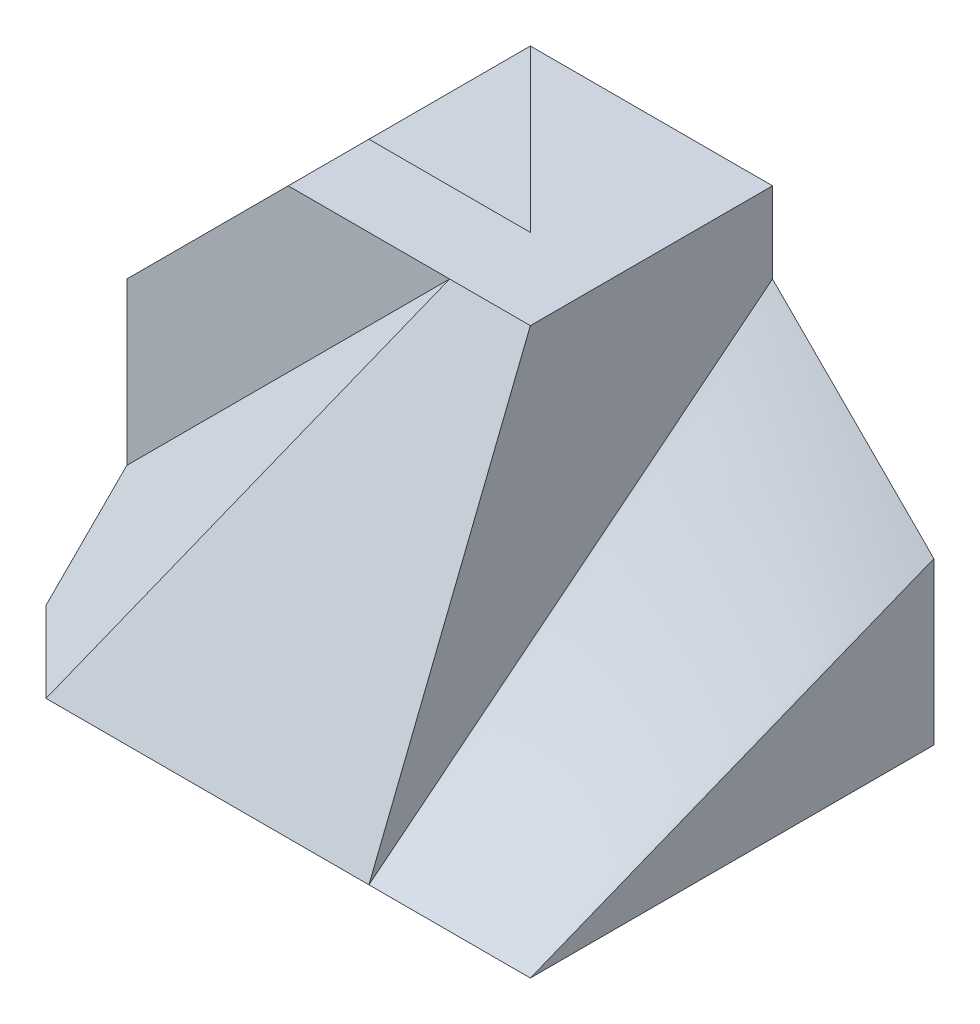
ISO-10303-21;
HEADER;
FILE_DESCRIPTION(('STEP AP214'),'2;1');
FILE_NAME('part.step','',(''),(''),'','','');
FILE_SCHEMA(('AUTOMOTIVE_DESIGN { 1 0 10303 214 1 1 1 1 }'));
ENDSEC;
DATA;
#1=APPLICATION_CONTEXT('core data for automotive mechanical design processes');
#2=APPLICATION_PROTOCOL_DEFINITION('international standard','automotive_design',2000,#1);
#3=PRODUCT_CONTEXT('',#1,'mechanical');
#4=PRODUCT('Part','Part','',(#3));
#5=PRODUCT_RELATED_PRODUCT_CATEGORY('part','',(#4));
#6=PRODUCT_DEFINITION_FORMATION('','',#4);
#7=PRODUCT_DEFINITION_CONTEXT('part definition',#1,'design');
#8=PRODUCT_DEFINITION('design','',#6,#7);
#9=PRODUCT_DEFINITION_SHAPE('','',#8);
#10=(LENGTH_UNIT() NAMED_UNIT(*) SI_UNIT(.MILLI.,.METRE.));
#11=(NAMED_UNIT(*) PLANE_ANGLE_UNIT() SI_UNIT($,.RADIAN.));
#12=(NAMED_UNIT(*) SI_UNIT($,.STERADIAN.) SOLID_ANGLE_UNIT());
#13=UNCERTAINTY_MEASURE_WITH_UNIT(LENGTH_MEASURE(1.E-05),#10,'distance_accuracy_value','');
#14=(GEOMETRIC_REPRESENTATION_CONTEXT(3) GLOBAL_UNCERTAINTY_ASSIGNED_CONTEXT((#13)) GLOBAL_UNIT_ASSIGNED_CONTEXT((#10,
#11,#12)) REPRESENTATION_CONTEXT('',''));
#15=CARTESIAN_POINT('',(0.,0.,0.));
#16=DIRECTION('',(0.,0.,1.));
#17=DIRECTION('',(1.,0.,0.));
#18=AXIS2_PLACEMENT_3D('',#15,#16,#17);
#19=CARTESIAN_POINT('',(0.,2.5,5.));
#20=DIRECTION('',(0.,1.,0.));
#21=DIRECTION('',(0.,0.,1.));
#22=AXIS2_PLACEMENT_3D('',#19,#20,#21);
#23=PLANE('',#22);
#24=DIRECTION('',(1.,0.,0.));
#25=VECTOR('',#24,1.);
#26=CARTESIAN_POINT('',(0.,2.5,0.));
#27=LINE('',#26,#25);
#28=CARTESIAN_POINT('',(-1.5,2.5,0.));
#29=VERTEX_POINT('',#28);
#30=CARTESIAN_POINT('',(1.5,2.5,0.));
#31=VERTEX_POINT('',#30);
#32=EDGE_CURVE('E273',#29,#31,#27,.T.);
#33=ORIENTED_EDGE('',*,*,#32,.F.);
#34=DIRECTION('',(-0.707106781186548,0.,-0.707106781186548));
#35=VECTOR('',#34,1.);
#36=CARTESIAN_POINT('',(0.5,2.5,2.));
#37=LINE('',#36,#35);
#38=CARTESIAN_POINT('',(0.5,2.5,2.));
#39=VERTEX_POINT('',#38);
#40=EDGE_CURVE('E395',#39,#29,#37,.T.);
#41=ORIENTED_EDGE('',*,*,#40,.F.);
#42=DIRECTION('',(-1.,0.,0.));
#43=VECTOR('',#42,1.);
#44=CARTESIAN_POINT('',(0.5,2.5,2.));
#45=LINE('',#44,#43);
#46=CARTESIAN_POINT('',(-1.5,2.5,2.));
#47=VERTEX_POINT('',#46);
#48=EDGE_CURVE('E397',#39,#47,#45,.T.);
#49=ORIENTED_EDGE('',*,*,#48,.T.);
#50=DIRECTION('',(0.,0.,-1.));
#51=VECTOR('',#50,1.);
#52=CARTESIAN_POINT('',(-1.5,2.5,5.));
#53=LINE('',#52,#51);
#54=CARTESIAN_POINT('',(-1.5,2.5,3.00000876569495));
#55=VERTEX_POINT('',#54);
#56=EDGE_CURVE('E203',#55,#47,#53,.T.);
#57=ORIENTED_EDGE('',*,*,#56,.F.);
#58=DIRECTION('',(0.999999999990395,0.,4.38284747471509E-06));
#59=VECTOR('',#58,1.);
#60=CARTESIAN_POINT('',(8.76562771661403E-06,2.5,3.00001534000458));
#61=LINE('',#60,#59);
#62=CARTESIAN_POINT('',(0.499979561030127,2.50000584373526,3.00001753130032));
#63=VERTEX_POINT('',#62);
#64=EDGE_CURVE('E57',#55,#63,#61,.T.);
#65=ORIENTED_EDGE('',*,*,#64,.T.);
#66=CARTESIAN_POINT('',(0.500000018550914,2.5,3.00000000000068));
#67=DIRECTION('',(0.999999985410378,0.,0.000170819331714001));
#68=VECTOR('',#67,1.);
#69=LINE('',#66,#68);
#70=CARTESIAN_POINT('',(1.5,2.5,3.0001369257335));
#71=VERTEX_POINT('',#70);
#72=EDGE_CURVE('E312',#63,#71,#69,.T.);
#73=ORIENTED_EDGE('',*,*,#72,.T.);
#74=DIRECTION('',(0.,0.,-1.));
#75=VECTOR('',#74,1.);
#76=CARTESIAN_POINT('',(1.5,2.5,5.));
#77=LINE('',#76,#75);
#78=EDGE_CURVE('E310',#71,#31,#77,.T.);
#79=ORIENTED_EDGE('',*,*,#78,.T.);
#80=EDGE_LOOP('',(#33,#41,#49,#57,#65,#73,#79));
#81=FACE_BOUND('',#80,.T.);
#82=ADVANCED_FACE('F38',(#81),#23,.T.);
#83=CARTESIAN_POINT('',(-2.,2.,5.));
#84=DIRECTION('',(-0.707106781186548,0.707106781186548,0.));
#85=DIRECTION('',(-0.707106781186548,-0.707106781186548,0.));
#86=AXIS2_PLACEMENT_3D('',#83,#84,#85);
#87=PLANE('',#86);
#88=DIRECTION('',(0.707106781186548,0.707106781186548,0.));
#89=VECTOR('',#88,1.);
#90=CARTESIAN_POINT('',(-2.,2.,2.));
#91=LINE('',#90,#89);
#92=CARTESIAN_POINT('',(-3.5,0.5,2.));
#93=VERTEX_POINT('',#92);
#94=EDGE_CURVE('E384',#93,#47,#91,.T.);
#95=ORIENTED_EDGE('',*,*,#94,.F.);
#96=DIRECTION('',(0.,0.,-1.));
#97=VECTOR('',#96,1.);
#98=CARTESIAN_POINT('',(-3.5,0.5,5.));
#99=LINE('',#98,#97);
#100=CARTESIAN_POINT('',(-3.5,0.5,3.));
#101=VERTEX_POINT('',#100);
#102=EDGE_CURVE('E425',#101,#93,#99,.T.);
#103=ORIENTED_EDGE('',*,*,#102,.F.);
#104=DIRECTION('',(0.707106781183152,0.707106781183152,3.09914117029226E-06));
#105=VECTOR('',#104,1.);
#106=CARTESIAN_POINT('',(-1.99999561716693,2.00000438283307,3.00000657429042));
#107=LINE('',#106,#105);
#108=EDGE_CURVE('E207',#101,#55,#107,.T.);
#109=ORIENTED_EDGE('',*,*,#108,.T.);
#110=ORIENTED_EDGE('',*,*,#56,.T.);
#111=EDGE_LOOP('',(#95,#103,#109,#110));
#112=FACE_BOUND('',#111,.T.);
#113=ADVANCED_FACE('F40',(#112),#87,.T.);
#114=CARTESIAN_POINT('',(-3.5,0.,5.));
#115=DIRECTION('',(-1.,0.,0.));
#116=DIRECTION('',(0.,0.,1.));
#117=AXIS2_PLACEMENT_3D('',#114,#115,#116);
#118=PLANE('',#117);
#119=DIRECTION('',(0.,-0.707106781186548,0.707106781186548));
#120=VECTOR('',#119,1.);
#121=CARTESIAN_POINT('',(-3.5,0.5,0.));
#122=LINE('',#121,#120);
#123=CARTESIAN_POINT('',(-3.5,0.5,0.));
#124=VERTEX_POINT('',#123);
#125=CARTESIAN_POINT('',(-3.5,-1.5,2.));
#126=VERTEX_POINT('',#125);
#127=EDGE_CURVE('E402',#124,#126,#122,.T.);
#128=ORIENTED_EDGE('',*,*,#127,.F.);
#129=DIRECTION('',(0.,1.,0.));
#130=VECTOR('',#129,1.);
#131=CARTESIAN_POINT('',(-3.5,0.,0.));
#132=LINE('',#131,#130);
#133=CARTESIAN_POINT('',(-3.5,-2.5,0.));
#134=VERTEX_POINT('',#133);
#135=EDGE_CURVE('E282',#134,#124,#132,.T.);
#136=ORIENTED_EDGE('',*,*,#135,.F.);
#137=DIRECTION('',(0.,0.,-1.));
#138=VECTOR('',#137,1.);
#139=CARTESIAN_POINT('',(-3.5,-2.5,5.));
#140=LINE('',#139,#138);
#141=CARTESIAN_POINT('',(-3.5,-2.5,3.99996610640178));
#142=VERTEX_POINT('',#141);
#143=EDGE_CURVE('E209',#142,#134,#140,.T.);
#144=ORIENTED_EDGE('',*,*,#143,.F.);
#145=DIRECTION('',(0.,0.707118764484653,-0.707094797685359));
#146=VECTOR('',#145,1.);
#147=CARTESIAN_POINT('',(-3.5,-2.5,3.99996610640178));
#148=LINE('',#147,#146);
#149=CARTESIAN_POINT('',(-3.5,-1.5,3.));
#150=VERTEX_POINT('',#149);
#151=EDGE_CURVE('E206',#142,#150,#148,.T.);
#152=ORIENTED_EDGE('',*,*,#151,.T.);
#153=DIRECTION('',(0.,1.,0.));
#154=VECTOR('',#153,1.);
#155=CARTESIAN_POINT('',(-3.5,-1.5,3.));
#156=LINE('',#155,#154);
#157=EDGE_CURVE('E529',#150,#101,#156,.T.);
#158=ORIENTED_EDGE('',*,*,#157,.T.);
#159=ORIENTED_EDGE('',*,*,#102,.T.);
#160=DIRECTION('',(0.,1.,0.));
#161=VECTOR('',#160,1.);
#162=CARTESIAN_POINT('',(-3.5,0.,2.));
#163=LINE('',#162,#161);
#164=EDGE_CURVE('E12',#126,#93,#163,.T.);
#165=ORIENTED_EDGE('',*,*,#164,.F.);
#166=EDGE_LOOP('',(#128,#136,#144,#152,#158,#159,#165));
#167=FACE_BOUND('',#166,.T.);
#168=ADVANCED_FACE('F336',(#167),#118,.T.);
#169=CARTESIAN_POINT('',(-0.000121535789236566,1.37933127299265,3.44831886277038));
#170=DIRECTION('',(-3.27240924574146E-05,0.37139154145744,0.928476344266778));
#171=DIRECTION('',(0.,-0.928476344763915,0.371391541656295));
#172=AXIS2_PLACEMENT_3D('',#169,#170,#171);
#173=PLANE('',#172);
#174=ORIENTED_EDGE('',*,*,#72,.F.);
#175=CARTESIAN_POINT('',(0.500097247583984,2.50029743964666,2.99994881444319));
#176=DIRECTION('',(-0.486656341146237,-0.811116815373522,0.32443045085268));
#177=VECTOR('',#176,1.);
#178=LINE('',#175,#177);
#179=CARTESIAN_POINT('',(-2.50000107027692,-2.50000294733509,4.99998490778983));
#180=VERTEX_POINT('',#179);
#181=EDGE_CURVE('E74',#63,#180,#178,.T.);
#182=ORIENTED_EDGE('',*,*,#181,.T.);
#183=CARTESIAN_POINT('',(-2.50000107027692,-2.50000589467018,4.99996981557966));
#184=DIRECTION('',(0.999999999448109,1.74802895943676E-05,2.82528046121385E-05));
#185=VECTOR('',#184,1.);
#186=LINE('',#183,#185);
#187=CARTESIAN_POINT('',(-1.57668284722899,-2.49999352934338,5.00000132108726));
#188=VERTEX_POINT('',#187);
#189=EDGE_CURVE('E121',#180,#188,#186,.T.);
#190=ORIENTED_EDGE('',*,*,#189,.T.);
#191=CARTESIAN_POINT('',(1.50007116417084,-2.5,5.));
#192=DIRECTION('',(-1.,0.,0.));
#193=VECTOR('',#192,1.);
#194=LINE('',#191,#193);
#195=CARTESIAN_POINT('',(1.5000711610525,-2.49965825417712,4.99997523280236));
#196=VERTEX_POINT('',#195);
#197=EDGE_CURVE('E127',#196,#188,#194,.T.);
#198=ORIENTED_EDGE('',*,*,#197,.F.);
#199=DIRECTION('',(0.,0.928476344763915,-0.371391541656295));
#200=VECTOR('',#199,1.);
#201=CARTESIAN_POINT('',(1.5,-2.50128790355298,5.00062360031391));
#202=LINE('',#201,#200);
#203=EDGE_CURVE('E133',#71,#196,#202,.F.);
#204=ORIENTED_EDGE('',*,*,#203,.F.);
#205=EDGE_LOOP('',(#174,#182,#190,#198,#204));
#206=FACE_BOUND('',#205,.T.);
#207=ADVANCED_FACE('F125',(#206),#173,.T.);
#208=CARTESIAN_POINT('',(1.5,0.,5.));
#209=DIRECTION('',(-1.,0.,0.));
#210=DIRECTION('',(0.,0.,1.));
#211=AXIS2_PLACEMENT_3D('',#208,#209,#210);
#212=PLANE('',#211);
#213=ORIENTED_EDGE('',*,*,#203,.T.);
#214=CARTESIAN_POINT('',(1.49999541451765,1.49999082903529,-5.50257882268755E-06));
#215=CARTESIAN_POINT('',(1.49994840950657,1.3332323725204,0.20826864952381));
#216=CARTESIAN_POINT('',(1.49991057515742,1.16649045298448,0.416556061851853));
#217=CARTESIAN_POINT('',(1.49986614044278,0.833069081610766,0.833168367624807));
#218=CARTESIAN_POINT('',(1.49985953893356,0.666389627709042,1.04149325941788));
#219=CARTESIAN_POINT('',(1.49989045658665,0.333117275337244,1.45819809519905));
#220=CARTESIAN_POINT('',(1.49992797391927,0.166524373564357,1.66657803654587));
#221=CARTESIAN_POINT('',(1.50000805383974,-0.166651293610344,2.08334391621995));
#222=CARTESIAN_POINT('',(1.50005061639657,-0.333234059068155,2.2917298545025));
#223=CARTESIAN_POINT('',(1.50010301782544,-0.666464239919107,2.70846146585302));
#224=CARTESIAN_POINT('',(1.50011285560424,-0.833111657286091,2.9168071373433));
#225=CARTESIAN_POINT('',(1.50008689268971,-1.1664963645163,3.33344195859731));
#226=CARTESIAN_POINT('',(1.50005108993744,-1.33323365809484,3.54173110538708));
#227=CARTESIAN_POINT('',(1.4999637716378,-1.66673666416649,3.95828678526797));
#228=CARTESIAN_POINT('',(1.4999122560861,-1.83350237666742,4.16655331835284));
#229=CARTESIAN_POINT('',(1.49991631024563,-2.16681963524899,4.58321489197007));
#230=CARTESIAN_POINT('',(1.4999718665587,-2.33337120551616,4.79160991316237));
#231=CARTESIAN_POINT('',(1.50014232834133,-2.49971534300216,5.00017079361561));
#232=B_SPLINE_CURVE_WITH_KNOTS('',3,(#214,#215,#216,#217,#218,#219,#220,#221,#222,#223,#224,
#225,#226,#227,#228,#229,#230,#231),.UNSPECIFIED.,.F.,.F.,(4,2,2,2,2,2,2,2,4),(0.,
0.800424014052249,1.60081871712363,2.40118022772789,3.20153682000441,4.00192014969071,
4.80233958770883,5.60275924609179,6.40307875246659),.UNSPECIFIED.);
#233=CARTESIAN_POINT('',(1.49999770725882,1.49999541451765,-2.75128941137549E-06));
#234=VERTEX_POINT('',#233);
#235=EDGE_CURVE('E269',#234,#196,#232,.T.);
#236=ORIENTED_EDGE('',*,*,#235,.F.);
#237=DIRECTION('',(0.,1.,0.));
#238=VECTOR('',#237,1.);
#239=CARTESIAN_POINT('',(1.5,0.,0.));
#240=LINE('',#239,#238);
#241=EDGE_CURVE('E304',#234,#31,#240,.T.);
#242=ORIENTED_EDGE('',*,*,#241,.T.);
#243=ORIENTED_EDGE('',*,*,#78,.F.);
#244=EDGE_LOOP('',(#213,#236,#242,#243));
#245=FACE_BOUND('',#244,.T.);
#246=ADVANCED_FACE('F166',(#245),#212,.F.);
#247=CARTESIAN_POINT('',(0.,-2.5,5.));
#248=DIRECTION('',(0.,1.,0.));
#249=DIRECTION('',(0.,0.,1.));
#250=AXIS2_PLACEMENT_3D('',#247,#248,#249);
#251=PLANE('',#250);
#252=ORIENTED_EDGE('',*,*,#189,.F.);
#253=DIRECTION('',(-0.707105469769942,4.16814030065119E-06,-0.707108092588436));
#254=VECTOR('',#253,1.);
#255=CARTESIAN_POINT('',(-2.50000000002425,-2.50000589465148,4.9999698156099));
#256=LINE('',#255,#254);
#257=EDGE_CURVE('E78',#180,#142,#256,.T.);
#258=ORIENTED_EDGE('',*,*,#257,.T.);
#259=ORIENTED_EDGE('',*,*,#143,.T.);
#260=DIRECTION('',(1.,0.,0.));
#261=VECTOR('',#260,1.);
#262=CARTESIAN_POINT('',(0.,-2.5,0.));
#263=LINE('',#262,#261);
#264=CARTESIAN_POINT('',(3.5,-2.5,0.));
#265=VERTEX_POINT('',#264);
#266=EDGE_CURVE('E143',#134,#265,#263,.T.);
#267=ORIENTED_EDGE('',*,*,#266,.T.);
#268=DIRECTION('',(0.,0.,-1.));
#269=VECTOR('',#268,1.);
#270=CARTESIAN_POINT('',(3.5,-2.5,5.));
#271=LINE('',#270,#269);
#272=CARTESIAN_POINT('',(3.49991274206597,-2.50017451586807,4.99881665488389));
#273=VERTEX_POINT('',#272);
#274=EDGE_CURVE('E197',#273,#265,#271,.T.);
#275=ORIENTED_EDGE('',*,*,#274,.F.);
#276=CARTESIAN_POINT('',(3.36726331566733,-2.4999999999985,5.00000000000091));
#277=CARTESIAN_POINT('',(3.37278190102175,-2.50002356724657,4.99998585965206));
#278=CARTESIAN_POINT('',(3.37830048257796,-2.50004779016226,4.99997132590264));
#279=CARTESIAN_POINT('',(3.38933697797447,-2.50009757158502,4.99994145704899));
#280=CARTESIAN_POINT('',(3.39485489181574,-2.50012312993214,4.99992612204072));
#281=CARTESIAN_POINT('',(3.40589003846994,-2.500175608897,4.99989463466181));
#282=CARTESIAN_POINT('',(3.41140727128393,-2.50020252934842,4.99987848239095));
#283=CARTESIAN_POINT('',(3.42244104266896,-2.50025775894702,4.99984534463179));
#284=CARTESIAN_POINT('',(3.42795758124117,-2.50028606792144,4.99982835924714));
#285=CARTESIAN_POINT('',(3.43898995104173,-2.50034410078097,4.99979353953142));
#286=CARTESIAN_POINT('',(3.44450578227136,-2.5003738244868,4.99977570530792));
#287=CARTESIAN_POINT('',(3.45553672440333,-2.50043471277923,4.99973917233246));
#288=CARTESIAN_POINT('',(3.46105183530707,-2.50046587717999,4.999720473692));
#289=CARTESIAN_POINT('',(3.47208132393126,-2.5005296726001,4.99968219643994));
#290=CARTESIAN_POINT('',(3.47759570165323,-2.50056230342701,4.99966261794379));
#291=CARTESIAN_POINT('',(3.48862371118297,-2.50062905710667,4.999622565736));
#292=CARTESIAN_POINT('',(3.49413734299237,-2.50066317976034,4.9996020921438));
#293=CARTESIAN_POINT('',(3.49965096826386,-2.50069806347228,4.99958116191663));
#294=B_SPLINE_CURVE_WITH_KNOTS('',3,(#276,#277,#278,#279,#280,#281,#282,#283,#284,#285,#286,
#287,#288,#289,#290,#291,#292,#293),.UNSPECIFIED.,.F.,.F.,(4,2,2,2,2,2,2,2,4),(0.,
0.0165559613382743,0.0331099441400149,0.0496619103069845,0.0662118221325194,0.082759642322429,
0.0993053340158685,0.115848860806154,0.132390186761554),.UNSPECIFIED.);
#295=CARTESIAN_POINT('',(3.36726331566733,-2.49999999999925,5.00000000000045));
#296=VERTEX_POINT('',#295);
#297=EDGE_CURVE('E267',#296,#273,#294,.T.);
#298=ORIENTED_EDGE('',*,*,#297,.F.);
#299=CARTESIAN_POINT('',(2.25685149969329,-2.5,5.));
#300=CARTESIAN_POINT('',(2.30314493826574,-2.49995615694013,5.00002630583592));
#301=CARTESIAN_POINT('',(2.34943835946116,-2.49990193299058,5.00005884020565));
#302=CARTESIAN_POINT('',(2.44203050456028,-2.49978288031112,5.00013027181333));
#303=CARTESIAN_POINT('',(2.48832922846191,-2.49971805036308,5.00016916978216));
#304=CARTESIAN_POINT('',(2.58092665884914,-2.49958795745946,5.00024722552433));
#305=CARTESIAN_POINT('',(2.62722536533474,-2.49952269450404,5.00028638329758));
#306=CARTESIAN_POINT('',(2.71981639077586,-2.49940470235338,5.00035717858798));
#307=CARTESIAN_POINT('',(2.76610870972814,-2.49935197142386,5.00038881714569));
#308=CARTESIAN_POINT('',(2.85867976542917,-2.49927348531611,5.00043590881034));
#309=CARTESIAN_POINT('',(2.9049585021675,-2.49924772220711,5.00045136667573));
#310=CARTESIAN_POINT('',(2.99749461014242,-2.49923884095394,5.00045669542764));
#311=CARTESIAN_POINT('',(3.04375198137393,-2.49925570311725,5.00044657812966));
#312=CARTESIAN_POINT('',(3.13623724168602,-2.49934843556776,5.00039093865935));
#313=CARTESIAN_POINT('',(3.18246513080851,-2.49942426832341,5.00034543900596));
#314=CARTESIAN_POINT('',(3.27488319352734,-2.49965143226598,5.00020914064041));
#315=CARTESIAN_POINT('',(3.32107336733333,-2.49980270222947,5.00011837866231));
#316=CARTESIAN_POINT('',(3.36726331566733,-2.4999999999985,5.00000000000091));
#317=B_SPLINE_CURVE_WITH_KNOTS('',3,(#299,#300,#301,#302,#303,#304,#305,#306,#307,#308,#309,
#310,#311,#312,#313,#314,#315,#316),.UNSPECIFIED.,.F.,.F.,(4,2,2,2,2,2,2,2,4),(0.,
0.138880393558547,0.277776749274178,0.416673056502972,0.555550130974456,0.694386352610776,
0.833158444783751,0.971842288317545,1.11041376136913),.UNSPECIFIED.);
#318=CARTESIAN_POINT('',(2.25685149969329,-2.5,5.));
#319=VERTEX_POINT('',#318);
#320=EDGE_CURVE('E266',#319,#296,#317,.T.);
#321=ORIENTED_EDGE('',*,*,#320,.F.);
#322=CARTESIAN_POINT('',(1.73267955607151,-2.50000000000001,4.99999999999999));
#323=CARTESIAN_POINT('',(1.7545106218277,-2.50002117271387,4.99998729637168));
#324=CARTESIAN_POINT('',(1.77634169070073,-2.500040114124,4.9999759315256));
#325=CARTESIAN_POINT('',(1.82000630950533,-2.50007303541751,4.9999561787495));
#326=CARTESIAN_POINT('',(1.84183985943748,-2.50008701473794,4.99994779115724));
#327=CARTESIAN_POINT('',(1.88550966997568,-2.50010950929713,4.99993429442172));
#328=CARTESIAN_POINT('',(1.90734593058222,-2.50011802385829,4.99992918568503));
#329=CARTESIAN_POINT('',(1.95102128985661,-2.50012934779481,4.99992239132312));
#330=CARTESIAN_POINT('',(1.97286038852473,-2.50013215642905,4.99992070614257));
#331=CARTESIAN_POINT('',(2.01654145379267,-2.50013200638191,4.99992079617086));
#332=CARTESIAN_POINT('',(2.03838342039249,-2.50012904694308,4.99992257183415));
#333=CARTESIAN_POINT('',(2.08207015836929,-2.50011749177903,4.99992950493258));
#334=CARTESIAN_POINT('',(2.10391492974602,-2.50010889532955,4.99993466280227));
#335=CARTESIAN_POINT('',(2.14760712568062,-2.50008636158527,4.99994818304884));
#336=CARTESIAN_POINT('',(2.16945455023804,-2.50007242364099,4.99995654581541));
#337=CARTESIAN_POINT('',(2.21315181742505,-2.50003971211727,4.99997617272964));
#338=CARTESIAN_POINT('',(2.23500166005411,-2.5000209380017,4.99998743719898));
#339=CARTESIAN_POINT('',(2.25685149969329,-2.5,5.));
#340=B_SPLINE_CURVE_WITH_KNOTS('',3,(#322,#323,#324,#325,#326,#327,#328,#329,#330,#331,#332,
#333,#334,#335,#336,#337,#338,#339),.UNSPECIFIED.,.F.,.F.,(4,2,2,2,2,2,2,2,4),(0.,
0.0654932392650817,0.130993906517863,0.196502694111021,0.262019989819616,0.327545889417185,
0.393080209486509,0.458622500537818,0.52417206049587),.UNSPECIFIED.);
#341=CARTESIAN_POINT('',(1.73267955607151,-2.5,5.));
#342=VERTEX_POINT('',#341);
#343=EDGE_CURVE('E268',#342,#319,#340,.T.);
#344=ORIENTED_EDGE('',*,*,#343,.F.);
#345=CARTESIAN_POINT('',(1.50014232834168,-2.49971534331664,5.00017079401002));
#346=CARTESIAN_POINT('',(1.50983070994002,-2.49972857571745,5.00016285456953));
#347=CARTESIAN_POINT('',(1.51951909156176,-2.49974179695031,5.00015492182982));
#348=CARTESIAN_POINT('',(1.53889593056649,-2.4997680878952,5.00013914726288));
#349=CARTESIAN_POINT('',(1.54858438794949,-2.49978115760606,5.00013130543637));
#350=CARTESIAN_POINT('',(1.56796144208414,-2.49980701629716,5.00011579022171));
#351=CARTESIAN_POINT('',(1.57765003883581,-2.49981980527337,5.00010811683598));
#352=CARTESIAN_POINT('',(1.59702743058003,-2.49984498532944,5.00009300880234));
#353=CARTESIAN_POINT('',(1.6067162255726,-2.49985737640117,5.0000855741593));
#354=CARTESIAN_POINT('',(1.62609406801487,-2.49988165206435,5.00007100876139));
#355=CARTESIAN_POINT('',(1.6357831154646,-2.49989353664264,5.00006387801442));
#356=CARTESIAN_POINT('',(1.65516151244887,-2.49991670026398,5.00004997984161));
#357=CARTESIAN_POINT('',(1.66485086198343,-2.4999279792882,5.00004321242708));
#358=CARTESIAN_POINT('',(1.68422990825177,-2.49994984109946,5.00003009534033));
#359=CARTESIAN_POINT('',(1.69391960498559,-2.49996042386161,5.00002374568304));
#360=CARTESIAN_POINT('',(1.71329938631251,-2.49998081369983,5.00001151178011));
#361=CARTESIAN_POINT('',(1.72298947090565,-2.49999062074492,5.00000562755305));
#362=CARTESIAN_POINT('',(1.73267955607151,-2.50000000000001,4.99999999999999));
#363=B_SPLINE_CURVE_WITH_KNOTS('',3,(#345,#346,#347,#348,#349,#350,#351,#352,#353,#354,#355,
#356,#357,#358,#359,#360,#361,#362),.UNSPECIFIED.,.F.,.F.,(4,2,2,2,2,2,2,2,4),(0.,
0.0290651816679439,0.0581305897819234,0.0871964144668771,0.116262831758296,0.145330003823881,
0.174398079182638,0.203467192921893,0.232537466912679),.UNSPECIFIED.);
#364=EDGE_CURVE('E140',#196,#342,#363,.T.);
#365=ORIENTED_EDGE('',*,*,#364,.F.);
#366=ORIENTED_EDGE('',*,*,#197,.T.);
#367=EDGE_LOOP('',(#252,#258,#259,#267,#275,#298,#321,#344,#365,#366));
#368=FACE_BOUND('',#367,.T.);
#369=ADVANCED_FACE('F138',(#368),#251,.F.);
#370=CARTESIAN_POINT('',(3.5,0.,5.));
#371=DIRECTION('',(-1.,0.,0.));
#372=DIRECTION('',(0.,0.,1.));
#373=AXIS2_PLACEMENT_3D('',#370,#371,#372);
#374=PLANE('',#373);
#375=DIRECTION('',(0.,1.,0.));
#376=VECTOR('',#375,1.);
#377=CARTESIAN_POINT('',(3.5,0.,0.));
#378=LINE('',#377,#376);
#379=CARTESIAN_POINT('',(3.5,-0.500000000000001,0.00153931321448001));
#380=VERTEX_POINT('',#379);
#381=EDGE_CURVE('E142',#265,#380,#378,.T.);
#382=ORIENTED_EDGE('',*,*,#381,.T.);
#383=CARTESIAN_POINT('',(3.49965096826387,-2.50069806347228,4.99958116191664));
#384=CARTESIAN_POINT('',(3.49989979079777,-2.41685205748829,4.79150884666684));
#385=CARTESIAN_POINT('',(3.50001802901267,-2.33328511486115,4.5833245670314));
#386=CARTESIAN_POINT('',(3.50011903153409,-2.16642217519592,4.16679343350114));
#387=CARTESIAN_POINT('',(3.50010176561066,-2.08312624276483,3.95844655369818));
#388=CARTESIAN_POINT('',(3.50005745475367,-1.91655163546189,3.54173530812748));
#389=CARTESIAN_POINT('',(3.50003040938816,-1.83327296151491,3.33337094199386));
#390=CARTESIAN_POINT('',(3.4999909696424,-1.66668549171182,2.91665774106239));
#391=CARTESIAN_POINT('',(3.49997857504919,-1.58337669631113,2.7083089060828));
#392=CARTESIAN_POINT('',(3.49995757992917,-1.4167514457074,2.29161560982937));
#393=CARTESIAN_POINT('',(3.49994897938178,-1.33343499054835,2.08327114853795));
#394=CARTESIAN_POINT('',(3.49992159419762,-1.1668231497885,1.66657175849649));
#395=CARTESIAN_POINT('',(3.49990280947378,-1.08352776437392,1.4582168296722));
#396=CARTESIAN_POINT('',(3.49987122065413,-0.916927680427245,1.0415207691237));
#397=CARTESIAN_POINT('',(3.49985841630681,-0.833622982434221,0.83317963718778));
#398=CARTESIAN_POINT('',(3.49997149092349,-0.666736213417496,0.41666377726939));
#399=CARTESIAN_POINT('',(3.50009733825366,-0.583154209998789,0.208489022169661));
#400=CARTESIAN_POINT('',(3.50035881502907,-0.499282369941861,0.000430578034884952));
#401=B_SPLINE_CURVE_WITH_KNOTS('',3,(#383,#384,#385,#386,#387,#388,#389,#390,#391,#392,#393,
#394,#395,#396,#397,#398,#399,#400),.UNSPECIFIED.,.F.,.F.,(4,2,2,2,2,2,2,2,4),(0.,
0.672991340692473,1.34613282491109,2.01930404476582,2.69246547982372,3.36562326387638,
4.03878680348967,4.71192202940129,5.38490370912526),.UNSPECIFIED.);
#402=EDGE_CURVE('E193',#273,#380,#401,.T.);
#403=ORIENTED_EDGE('',*,*,#402,.F.);
#404=ORIENTED_EDGE('',*,*,#274,.T.);
#405=EDGE_LOOP('',(#382,#403,#404));
#406=FACE_BOUND('',#405,.T.);
#407=ADVANCED_FACE('F169',(#406),#374,.F.);
#408=CARTESIAN_POINT('',(0.,0.,0.));
#409=DIRECTION('',(0.,0.,1.));
#410=DIRECTION('',(1.,0.,0.));
#411=AXIS2_PLACEMENT_3D('',#408,#409,#410);
#412=PLANE('',#411);
#413=CARTESIAN_POINT('',(3.5,-0.500000000000001,0.00307862642895992));
#414=CARTESIAN_POINT('',(3.49488199158733,-0.494895118854369,0.00294509241373774));
#415=CARTESIAN_POINT('',(3.48976484819947,-0.489789351997541,0.00281226575341444));
#416=CARTESIAN_POINT('',(3.47953170024454,-0.479575540466763,0.00254797908646277));
#417=CARTESIAN_POINT('',(3.47441569585927,-0.474467495606826,0.00241651922843426));
#418=CARTESIAN_POINT('',(3.46418479831916,-0.464249183186009,0.00215493308292221));
#419=CARTESIAN_POINT('',(3.45906990533772,-0.459138915447901,0.00202480693710443));
#420=CARTESIAN_POINT('',(3.44884120345887,-0.448916211588785,0.00176585563044977));
#421=CARTESIAN_POINT('',(3.44372739472674,-0.443803775298988,0.00163703060458965));
#422=CARTESIAN_POINT('',(3.43350083448945,-0.433576788049658,0.00138064930974537));
#423=CARTESIAN_POINT('',(3.42838808314171,-0.428462236929488,0.0012530931692752));
#424=CARTESIAN_POINT('',(3.41816361116308,-0.418231073052534,0.000999217828021176));
#425=CARTESIAN_POINT('',(3.41305189068203,-0.413114460142969,0.000872898749516137));
#426=CARTESIAN_POINT('',(3.40282945422112,-0.402879225100984,0.000621466080281922));
#427=CARTESIAN_POINT('',(3.39771873838379,-0.397760602823359,0.000496352605815293));
#428=CARTESIAN_POINT('',(3.38749828546421,-0.387521400626596,0.000247300214420627));
#429=CARTESIAN_POINT('',(3.38238854851745,-0.382400820569535,0.000123361407968288));
#430=CARTESIAN_POINT('',(3.37727951995241,-0.377279519952412,0.));
#431=B_SPLINE_CURVE_WITH_KNOTS('',3,(#413,#414,#415,#416,#417,#418,#419,#420,#421,#422,#423,
#424,#425,#426,#427,#428,#429,#430),.UNSPECIFIED.,.F.,.F.,(4,2,2,2,2,2,2,2,4),(0.,
0.0216897410925913,0.0433818161582694,0.065076171943507,0.0867727556265264,0.108471514834622,
0.130172397661131,0.151875352681989,0.17358032897189),.UNSPECIFIED.);
#432=CARTESIAN_POINT('',(3.37727951995242,-0.377279519952416,0.));
#433=VERTEX_POINT('',#432);
#434=EDGE_CURVE('E199',#433,#380,#431,.F.);
#435=ORIENTED_EDGE('',*,*,#434,.T.);
#436=ORIENTED_EDGE('',*,*,#381,.F.);
#437=ORIENTED_EDGE('',*,*,#266,.F.);
#438=ORIENTED_EDGE('',*,*,#135,.T.);
#439=DIRECTION('',(0.707106781186548,0.707106781186548,0.));
#440=VECTOR('',#439,1.);
#441=CARTESIAN_POINT('',(-2.,2.,0.));
#442=LINE('',#441,#440);
#443=EDGE_CURVE('E276',#124,#29,#442,.T.);
#444=ORIENTED_EDGE('',*,*,#443,.T.);
#445=ORIENTED_EDGE('',*,*,#32,.T.);
#446=ORIENTED_EDGE('',*,*,#241,.F.);
#447=CARTESIAN_POINT('',(3.37727951988541,-0.377279519885874,-1.83257272204362E-13));
#448=CARTESIAN_POINT('',(3.2988496042887,-0.299374322391246,-0.00020988724101948));
#449=CARTESIAN_POINT('',(3.22054043907284,-0.221347865991132,-0.000322970767314099));
#450=CARTESIAN_POINT('',(3.06402218190857,-0.0650947402357685,-0.000429023330877855));
#451=CARTESIAN_POINT('',(2.98581318566132,0.013132025084651,-0.000421915701609701));
#452=CARTESIAN_POINT('',(2.82943199234724,0.169665532263279,-0.000360990155793033));
#453=CARTESIAN_POINT('',(2.75125981149255,0.247972290280896,-0.000307159290620116));
#454=CARTESIAN_POINT('',(2.59491792978643,0.404594892737299,-0.000194870990507681));
#455=CARTESIAN_POINT('',(2.51674822917878,0.482910737420057,-0.000136413360464629));
#456=CARTESIAN_POINT('',(2.36039281454849,0.63951378693017,-3.73594085354545E-05));
#457=CARTESIAN_POINT('',(2.28220710233526,0.717800993563214,3.23835938816296E-06));
#458=CARTESIAN_POINT('',(2.12581495858103,0.874335751118821,6.02838799397746E-05));
#459=CARTESIAN_POINT('',(2.04760853070225,0.952583305698977,7.67345604910583E-05));
#460=CARTESIAN_POINT('',(1.89117737070011,1.1090419088094,8.77118038043825E-05));
#461=CARTESIAN_POINT('',(1.8129526417658,1.1872529605282,8.22409176010342E-05));
#462=CARTESIAN_POINT('',(1.65648717833141,1.34364305511109,5.20933770035933E-05));
#463=CARTESIAN_POINT('',(1.5782464462843,1.42182210042966,2.74186855870949E-05));
#464=CARTESIAN_POINT('',(1.49999541451765,1.49999082903529,-5.50257882298909E-06));
#465=B_SPLINE_CURVE_WITH_KNOTS('',3,(#447,#448,#449,#450,#451,#452,#453,#454,#455,#456,#457,
#458,#459,#460,#461,#462,#463,#464),.UNSPECIFIED.,.F.,.F.,(4,2,2,2,2,2,2,2,4),(0.,
0.331638600392777,0.663488751640108,0.99543089941513,1.32738705214363,1.65931632283767,
1.99120534255931,2.32305574114608,2.65487222305084),.UNSPECIFIED.);
#466=EDGE_CURVE('E271',#433,#234,#465,.T.);
#467=ORIENTED_EDGE('',*,*,#466,.F.);
#468=EDGE_LOOP('',(#435,#436,#437,#438,#444,#445,#446,#467));
#469=FACE_BOUND('',#468,.T.);
#470=ADVANCED_FACE('F173',(#469),#412,.F.);
#471=CARTESIAN_POINT('',(3.43169605771523,0.0300495127993888,-1.07518291724808));
#472=CARTESIAN_POINT('',(3.06303198695938,0.377774964482538,-0.842652597184929));
#473=CARTESIAN_POINT('',(2.68339099476235,0.703546573283309,-0.623294582851207));
#474=CARTESIAN_POINT('',(2.29151024153656,1.00483866002656,-0.418624281752002));
#475=CARTESIAN_POINT('',(1.89047431133508,1.28782039281843,-0.224940193023602));
#476=CARTESIAN_POINT('',(1.48057334875958,1.55307206086225,-0.0418941431440316));
#477=CARTESIAN_POINT('',(3.51779133411732,-0.5879837534006,0.0821347171772351));
#478=CARTESIAN_POINT('',(3.1284440743645,-0.281624679711426,0.289845210444055));
#479=CARTESIAN_POINT('',(2.72863126724935,0.00380329925306398,0.484997046876056));
#480=CARTESIAN_POINT('',(2.31647398402424,0.264542325997679,0.665335511976121));
#481=CARTESIAN_POINT('',(1.89587949466018,0.508406940464369,0.835549329709435));
#482=CARTESIAN_POINT('',(1.46612269921897,0.733946942776756,0.994768380150173));
#483=CARTESIAN_POINT('',(3.63460974510093,-1.1445707504378,1.27632011310068));
#484=CARTESIAN_POINT('',(3.21420647039844,-0.900323706647914,1.44676338842782));
#485=CARTESIAN_POINT('',(2.78437021820628,-0.674942617837364,1.60588709076739));
#486=CARTESIAN_POINT('',(2.34735344542847,-0.463922570198169,1.75639416840419));
#487=CARTESIAN_POINT('',(1.90190301159961,-0.269769844661068,1.89678085277973));
#488=CARTESIAN_POINT('',(1.44949750863624,-0.0895272573929876,2.02882145419387));
#489=CARTESIAN_POINT('',(3.76578217109377,-1.67244971745626,2.48773032703493));
#490=CARTESIAN_POINT('',(3.30875953190704,-1.50144140263492,2.61423036498105));
#491=CARTESIAN_POINT('',(2.84749628770541,-1.3389142978434,2.73564167690928));
#492=CARTESIAN_POINT('',(2.380415195612,-1.18802288883536,2.85007157136737));
#493=CARTESIAN_POINT('',(1.91013226258592,-1.04353516169271,2.96065925670625));
#494=CARTESIAN_POINT('',(1.43379446599942,-0.911157161670888,3.06398110577262));
#495=CARTESIAN_POINT('',(3.93091597079068,-2.13240593706678,3.7398941894142));
#496=CARTESIAN_POINT('',(3.43501350537431,-2.0391572747047,3.81973843588474));
#497=CARTESIAN_POINT('',(2.93441230609471,-1.95530608006907,3.89394420171939));
#498=CARTESIAN_POINT('',(2.4302450313063,-1.87858703645107,3.96387067694348));
#499=CARTESIAN_POINT('',(1.92073980707189,-1.81254389172504,4.02739161283237));
#500=CARTESIAN_POINT('',(1.40955108898511,-1.74986773470378,4.08889235609841));
#501=CARTESIAN_POINT('',(4.13192048447464,-2.52062072870312,5.0351029085779));
#502=CARTESIAN_POINT('',(3.59021267978152,-2.51898274489453,5.05998074791634));
#503=CARTESIAN_POINT('',(3.04230857994431,-2.52973735137413,5.07742303308188));
#504=CARTESIAN_POINT('',(2.48846042341614,-2.55238007123564,5.08773245021824));
#505=CARTESIAN_POINT('',(1.93717856517518,-2.56989019452273,5.10112142529927));
#506=CARTESIAN_POINT('',(1.38384781654066,-2.59149809859695,5.11205173190802));
#507=B_SPLINE_SURFACE_WITH_KNOTS('',5,5,((#471,#472,#473,#474,#475,#476),(#477,#478,#479,#480,
#481,#482),(#483,#484,#485,#486,#487,#488),(#489,#490,#491,#492,#493,#494),(#495,#496,#497,#498,
#499,#500),(#501,#502,#503,#504,#505,#506)),.UNSPECIFIED.,.F.,.F.,.F.,(6,6),(6,6),
(-3.54253483377692,3.01472451198884),(-1.37827890686165,1.14117330794568),.UNSPECIFIED.);
#508=ORIENTED_EDGE('',*,*,#466,.T.);
#509=ORIENTED_EDGE('',*,*,#235,.T.);
#510=ORIENTED_EDGE('',*,*,#364,.T.);
#511=ORIENTED_EDGE('',*,*,#343,.T.);
#512=ORIENTED_EDGE('',*,*,#320,.T.);
#513=ORIENTED_EDGE('',*,*,#297,.T.);
#514=ORIENTED_EDGE('',*,*,#402,.T.);
#515=ORIENTED_EDGE('',*,*,#434,.F.);
#516=EDGE_LOOP('',(#508,#509,#510,#511,#512,#513,#514,#515));
#517=FACE_BOUND('',#516,.T.);
#518=ADVANCED_FACE('F214',(#517),#507,.F.);
#519=CARTESIAN_POINT('',(-1.66668020832491,1.66666248238105,1.66670193022334));
#520=DIRECTION('',(-0.577349807753609,0.577343667361333,0.577357332372801));
#521=DIRECTION('',(0.707111389014572,0.,0.707102173328496));
#522=AXIS2_PLACEMENT_3D('',#519,#520,#521);
#523=PLANE('',#522);
#524=ORIENTED_EDGE('',*,*,#151,.F.);
#525=ORIENTED_EDGE('',*,*,#257,.F.);
#526=ORIENTED_EDGE('',*,*,#181,.F.);
#527=DIRECTION('',(0.707105749355222,0.707107813009576,3.09913664794782E-06));
#528=VECTOR('',#527,1.);
#529=CARTESIAN_POINT('',(-3.5,-1.5,3.));
#530=LINE('',#529,#528);
#531=EDGE_CURVE('E48',#150,#63,#530,.T.);
#532=ORIENTED_EDGE('',*,*,#531,.F.);
#533=EDGE_LOOP('',(#524,#525,#526,#532));
#534=FACE_BOUND('',#533,.T.);
#535=ADVANCED_FACE('F225',(#534),#523,.T.);
#536=CARTESIAN_POINT('',(-3.5,-1.5,3.));
#537=DIRECTION('',(-4.38284747471509E-06,0.,0.999999999990395));
#538=DIRECTION('',(0.999999999990395,0.,4.38284747471509E-06));
#539=AXIS2_PLACEMENT_3D('',#536,#537,#538);
#540=PLANE('',#539);
#541=ORIENTED_EDGE('',*,*,#108,.F.);
#542=ORIENTED_EDGE('',*,*,#157,.F.);
#543=ORIENTED_EDGE('',*,*,#531,.T.);
#544=ORIENTED_EDGE('',*,*,#64,.F.);
#545=EDGE_LOOP('',(#541,#542,#543,#544));
#546=FACE_BOUND('',#545,.T.);
#547=ADVANCED_FACE('F227',(#546),#540,.T.);
#548=CARTESIAN_POINT('',(-1.33333333333333,1.33333333333333,1.33333333333333));
#549=DIRECTION('',(-0.577350269189626,0.577350269189626,0.577350269189626));
#550=DIRECTION('',(0.,-0.707106781186548,0.707106781186548));
#551=AXIS2_PLACEMENT_3D('',#548,#549,#550);
#552=PLANE('',#551);
#553=ORIENTED_EDGE('',*,*,#127,.T.);
#554=DIRECTION('',(0.707106781186548,0.707106781186548,0.));
#555=VECTOR('',#554,1.);
#556=CARTESIAN_POINT('',(-3.5,-1.5,2.));
#557=LINE('',#556,#555);
#558=EDGE_CURVE('E392',#126,#39,#557,.T.);
#559=ORIENTED_EDGE('',*,*,#558,.T.);
#560=ORIENTED_EDGE('',*,*,#40,.T.);
#561=ORIENTED_EDGE('',*,*,#443,.F.);
#562=EDGE_LOOP('',(#553,#559,#560,#561));
#563=FACE_BOUND('',#562,.T.);
#564=ADVANCED_FACE('F415',(#563),#552,.T.);
#565=CARTESIAN_POINT('',(-3.5,-1.5,2.));
#566=DIRECTION('',(0.,0.,1.));
#567=DIRECTION('',(1.,0.,0.));
#568=AXIS2_PLACEMENT_3D('',#565,#566,#567);
#569=PLANE('',#568);
#570=ORIENTED_EDGE('',*,*,#94,.T.);
#571=ORIENTED_EDGE('',*,*,#48,.F.);
#572=ORIENTED_EDGE('',*,*,#558,.F.);
#573=ORIENTED_EDGE('',*,*,#164,.T.);
#574=EDGE_LOOP('',(#570,#571,#572,#573));
#575=FACE_BOUND('',#574,.T.);
#576=ADVANCED_FACE('F428',(#575),#569,.F.);
#577=CLOSED_SHELL('',(#82,#113,#168,#207,#246,#369,#407,#470,#518,#535,#547,#564,#576));
#578=MANIFOLD_SOLID_BREP('B2',#577);
#579=ADVANCED_BREP_SHAPE_REPRESENTATION('',(#18,#578),#14);
#580=SHAPE_DEFINITION_REPRESENTATION(#9,#579);
ENDSEC;
END-ISO-10303-21;
